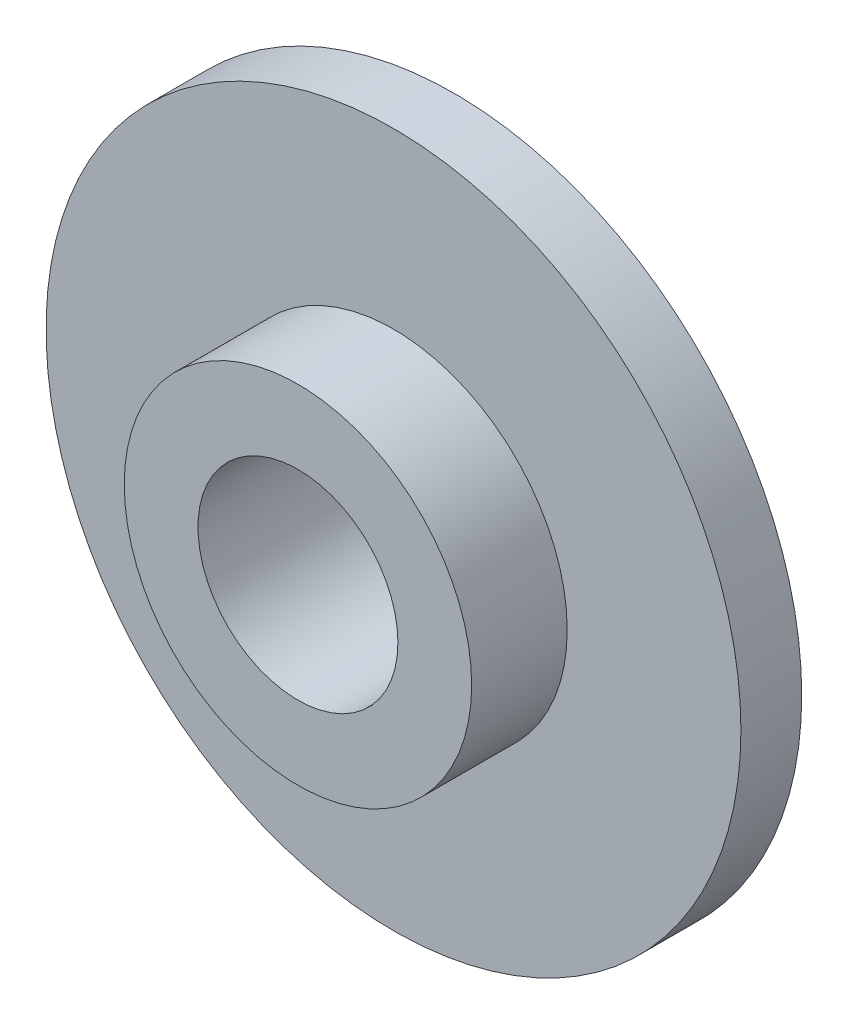
ISO-10303-21;
HEADER;
FILE_DESCRIPTION(('STEP AP214'),'2;1');
FILE_NAME('part.step','',(''),(''),'','','');
FILE_SCHEMA(('AUTOMOTIVE_DESIGN { 1 0 10303 214 1 1 1 1 }'));
ENDSEC;
DATA;
#1=APPLICATION_CONTEXT('core data for automotive mechanical design processes');
#2=APPLICATION_PROTOCOL_DEFINITION('international standard','automotive_design',2000,#1);
#3=PRODUCT_CONTEXT('',#1,'mechanical');
#4=PRODUCT('Part','Part','',(#3));
#5=PRODUCT_RELATED_PRODUCT_CATEGORY('part','',(#4));
#6=PRODUCT_DEFINITION_FORMATION('','',#4);
#7=PRODUCT_DEFINITION_CONTEXT('part definition',#1,'design');
#8=PRODUCT_DEFINITION('design','',#6,#7);
#9=PRODUCT_DEFINITION_SHAPE('','',#8);
#10=(LENGTH_UNIT() NAMED_UNIT(*) SI_UNIT(.MILLI.,.METRE.));
#11=(NAMED_UNIT(*) PLANE_ANGLE_UNIT() SI_UNIT($,.RADIAN.));
#12=(NAMED_UNIT(*) SI_UNIT($,.STERADIAN.) SOLID_ANGLE_UNIT());
#13=UNCERTAINTY_MEASURE_WITH_UNIT(LENGTH_MEASURE(1.E-05),#10,'distance_accuracy_value','');
#14=(GEOMETRIC_REPRESENTATION_CONTEXT(3) GLOBAL_UNCERTAINTY_ASSIGNED_CONTEXT((#13)) GLOBAL_UNIT_ASSIGNED_CONTEXT((#10,
#11,#12)) REPRESENTATION_CONTEXT('',''));
#15=CARTESIAN_POINT('',(0.,0.,0.));
#16=DIRECTION('',(0.,0.,1.));
#17=DIRECTION('',(1.,0.,0.));
#18=AXIS2_PLACEMENT_3D('',#15,#16,#17);
#19=CARTESIAN_POINT('',(0.,0.,1.778));
#20=DIRECTION('',(0.,0.,-1.));
#21=DIRECTION('',(-1.,0.,0.));
#22=AXIS2_PLACEMENT_3D('',#19,#20,#21);
#23=CYLINDRICAL_SURFACE('',#22,10.16);
#24=CARTESIAN_POINT('',(0.,0.,1.778));
#25=DIRECTION('',(0.,0.,1.));
#26=DIRECTION('',(1.,0.,0.));
#27=AXIS2_PLACEMENT_3D('',#24,#25,#26);
#28=CIRCLE('',#27,10.16);
#29=CARTESIAN_POINT('',(10.16,0.,1.778));
#30=VERTEX_POINT('',#29);
#31=EDGE_CURVE('E39',#30,#30,#28,.T.);
#32=ORIENTED_EDGE('',*,*,#31,.F.);
#33=EDGE_LOOP('',(#32));
#34=FACE_BOUND('',#33,.T.);
#35=CARTESIAN_POINT('',(0.,0.,0.));
#36=DIRECTION('',(0.,0.,1.));
#37=DIRECTION('',(1.,0.,0.));
#38=AXIS2_PLACEMENT_3D('',#35,#36,#37);
#39=CIRCLE('',#38,10.16);
#40=CARTESIAN_POINT('',(10.16,0.,0.));
#41=VERTEX_POINT('',#40);
#42=EDGE_CURVE('E35',#41,#41,#39,.T.);
#43=ORIENTED_EDGE('',*,*,#42,.T.);
#44=EDGE_LOOP('',(#43));
#45=FACE_BOUND('',#44,.T.);
#46=ADVANCED_FACE('F32',(#34,#45),#23,.T.);
#47=CARTESIAN_POINT('',(0.,0.,1.778));
#48=DIRECTION('',(0.,0.,1.));
#49=DIRECTION('',(1.,0.,0.));
#50=AXIS2_PLACEMENT_3D('',#47,#48,#49);
#51=PLANE('',#50);
#52=CARTESIAN_POINT('',(0.,0.,1.778));
#53=DIRECTION('',(0.,0.,1.));
#54=DIRECTION('',(1.,0.,0.));
#55=AXIS2_PLACEMENT_3D('',#52,#53,#54);
#56=CIRCLE('',#55,5.08);
#57=CARTESIAN_POINT('',(5.08,0.,1.778));
#58=VERTEX_POINT('',#57);
#59=EDGE_CURVE('E10',#58,#58,#56,.T.);
#60=ORIENTED_EDGE('',*,*,#59,.F.);
#61=EDGE_LOOP('',(#60));
#62=FACE_BOUND('',#61,.T.);
#63=ORIENTED_EDGE('',*,*,#31,.T.);
#64=EDGE_LOOP('',(#63));
#65=FACE_BOUND('',#64,.T.);
#66=ADVANCED_FACE('F76',(#62,#65),#51,.T.);
#67=CARTESIAN_POINT('',(0.,0.,0.));
#68=DIRECTION('',(0.,0.,1.));
#69=DIRECTION('',(1.,0.,0.));
#70=AXIS2_PLACEMENT_3D('',#67,#68,#69);
#71=PLANE('',#70);
#72=CARTESIAN_POINT('',(0.,0.,0.));
#73=DIRECTION('',(0.,0.,1.));
#74=DIRECTION('',(1.,0.,0.));
#75=AXIS2_PLACEMENT_3D('',#72,#73,#74);
#76=CIRCLE('',#75,2.92345749910196);
#77=CARTESIAN_POINT('',(2.92345749910196,0.,0.));
#78=VERTEX_POINT('',#77);
#79=EDGE_CURVE('E48',#78,#78,#76,.T.);
#80=ORIENTED_EDGE('',*,*,#79,.T.);
#81=EDGE_LOOP('',(#80));
#82=FACE_BOUND('',#81,.T.);
#83=ORIENTED_EDGE('',*,*,#42,.F.);
#84=EDGE_LOOP('',(#83));
#85=FACE_BOUND('',#84,.T.);
#86=ADVANCED_FACE('F55',(#82,#85),#71,.F.);
#87=CARTESIAN_POINT('',(0.,0.,4.572));
#88=DIRECTION('',(0.,0.,-1.));
#89=DIRECTION('',(-1.,0.,0.));
#90=AXIS2_PLACEMENT_3D('',#87,#88,#89);
#91=CYLINDRICAL_SURFACE('',#90,5.08);
#92=CARTESIAN_POINT('',(0.,0.,4.572));
#93=DIRECTION('',(0.,0.,1.));
#94=DIRECTION('',(1.,0.,0.));
#95=AXIS2_PLACEMENT_3D('',#92,#93,#94);
#96=CIRCLE('',#95,5.08);
#97=CARTESIAN_POINT('',(5.08,0.,4.572));
#98=VERTEX_POINT('',#97);
#99=EDGE_CURVE('E45',#98,#98,#96,.T.);
#100=ORIENTED_EDGE('',*,*,#99,.F.);
#101=EDGE_LOOP('',(#100));
#102=FACE_BOUND('',#101,.T.);
#103=ORIENTED_EDGE('',*,*,#59,.T.);
#104=EDGE_LOOP('',(#103));
#105=FACE_BOUND('',#104,.T.);
#106=ADVANCED_FACE('F67',(#102,#105),#91,.T.);
#107=CARTESIAN_POINT('',(0.,0.,4.572));
#108=DIRECTION('',(0.,0.,1.));
#109=DIRECTION('',(1.,0.,0.));
#110=AXIS2_PLACEMENT_3D('',#107,#108,#109);
#111=PLANE('',#110);
#112=CARTESIAN_POINT('',(0.,0.,4.572));
#113=DIRECTION('',(0.,0.,1.));
#114=DIRECTION('',(1.,0.,0.));
#115=AXIS2_PLACEMENT_3D('',#112,#113,#114);
#116=CIRCLE('',#115,2.92345749910196);
#117=CARTESIAN_POINT('',(2.92345749910196,0.,4.572));
#118=VERTEX_POINT('',#117);
#119=EDGE_CURVE('E49',#118,#118,#116,.T.);
#120=ORIENTED_EDGE('',*,*,#119,.F.);
#121=EDGE_LOOP('',(#120));
#122=FACE_BOUND('',#121,.T.);
#123=ORIENTED_EDGE('',*,*,#99,.T.);
#124=EDGE_LOOP('',(#123));
#125=FACE_BOUND('',#124,.T.);
#126=ADVANCED_FACE('F61',(#122,#125),#111,.T.);
#127=CARTESIAN_POINT('',(0.,0.,0.));
#128=DIRECTION('',(0.,0.,1.));
#129=DIRECTION('',(1.,0.,0.));
#130=AXIS2_PLACEMENT_3D('',#127,#128,#129);
#131=CYLINDRICAL_SURFACE('',#130,2.92345749910196);
#132=ORIENTED_EDGE('',*,*,#79,.F.);
#133=EDGE_LOOP('',(#132));
#134=FACE_BOUND('',#133,.T.);
#135=ORIENTED_EDGE('',*,*,#119,.T.);
#136=EDGE_LOOP('',(#135));
#137=FACE_BOUND('',#136,.T.);
#138=ADVANCED_FACE('F58',(#134,#137),#131,.F.);
#139=CLOSED_SHELL('',(#46,#66,#86,#106,#126,#138));
#140=MANIFOLD_SOLID_BREP('B2',#139);
#141=ADVANCED_BREP_SHAPE_REPRESENTATION('',(#18,#140),#14);
#142=SHAPE_DEFINITION_REPRESENTATION(#9,#141);
ENDSEC;
END-ISO-10303-21;
